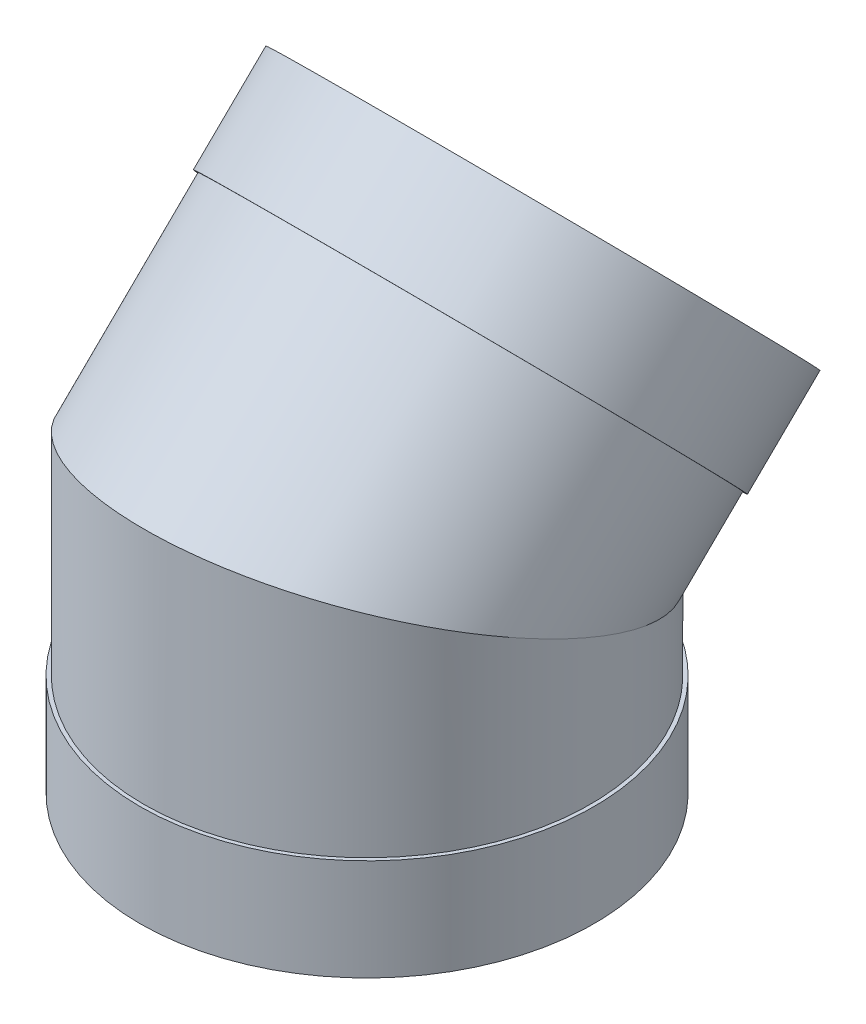
ISO-10303-21;
HEADER;
FILE_DESCRIPTION(('STEP AP214'),'2;1');
FILE_NAME('part.step','',(''),(''),'','','');
FILE_SCHEMA(('AUTOMOTIVE_DESIGN { 1 0 10303 214 1 1 1 1 }'));
ENDSEC;
DATA;
#1=APPLICATION_CONTEXT('core data for automotive mechanical design processes');
#2=APPLICATION_PROTOCOL_DEFINITION('international standard','automotive_design',2000,#1);
#3=PRODUCT_CONTEXT('',#1,'mechanical');
#4=PRODUCT('Part','Part','',(#3));
#5=PRODUCT_RELATED_PRODUCT_CATEGORY('part','',(#4));
#6=PRODUCT_DEFINITION_FORMATION('','',#4);
#7=PRODUCT_DEFINITION_CONTEXT('part definition',#1,'design');
#8=PRODUCT_DEFINITION('design','',#6,#7);
#9=PRODUCT_DEFINITION_SHAPE('','',#8);
#10=(LENGTH_UNIT() NAMED_UNIT(*) SI_UNIT(.MILLI.,.METRE.));
#11=(NAMED_UNIT(*) PLANE_ANGLE_UNIT() SI_UNIT($,.RADIAN.));
#12=(NAMED_UNIT(*) SI_UNIT($,.STERADIAN.) SOLID_ANGLE_UNIT());
#13=UNCERTAINTY_MEASURE_WITH_UNIT(LENGTH_MEASURE(1.E-05),#10,'distance_accuracy_value','');
#14=(GEOMETRIC_REPRESENTATION_CONTEXT(3) GLOBAL_UNCERTAINTY_ASSIGNED_CONTEXT((#13)) GLOBAL_UNIT_ASSIGNED_CONTEXT((#10,
#11,#12)) REPRESENTATION_CONTEXT('',''));
#15=CARTESIAN_POINT('',(0.,0.,0.));
#16=DIRECTION('',(0.,0.,1.));
#17=DIRECTION('',(1.,0.,0.));
#18=AXIS2_PLACEMENT_3D('',#15,#16,#17);
#19=CARTESIAN_POINT('',(0.,577.808035197474,-275.631800032306));
#20=DIRECTION('',(0.,0.699550093273346,-0.714583561944475));
#21=DIRECTION('',(0.,-0.714583561944475,-0.699550093273346));
#22=AXIS2_PLACEMENT_3D('',#19,#20,#21);
#23=CYLINDRICAL_SURFACE('',#22,279.4);
#24=CARTESIAN_POINT('',(0.,434.576078130144,-129.321760122901));
#25=DIRECTION('',(0.,-0.699550093273346,0.714583561944475));
#26=DIRECTION('',(0.,-0.714583561944475,-0.699550093273346));
#27=AXIS2_PLACEMENT_3D('',#24,#25,#26);
#28=CIRCLE('',#27,279.4);
#29=CARTESIAN_POINT('',(0.,234.921430922858,-324.776056183474));
#30=VERTEX_POINT('',#29);
#31=EDGE_CURVE('E67',#30,#30,#28,.T.);
#32=ORIENTED_EDGE('',*,*,#31,.T.);
#33=EDGE_LOOP('',(#32));
#34=FACE_BOUND('',#33,.T.);
#35=CARTESIAN_POINT('',(0.,523.418939975859,-220.07387248985));
#36=DIRECTION('',(0.,-0.699550093273346,0.714583561944475));
#37=DIRECTION('',(0.,-0.714583561944475,-0.699550093273346));
#38=AXIS2_PLACEMENT_3D('',#35,#36,#37);
#39=CIRCLE('',#38,279.4);
#40=CARTESIAN_POINT('',(0.,323.764292768572,-415.528168550422));
#41=VERTEX_POINT('',#40);
#42=EDGE_CURVE('E11',#41,#41,#39,.T.);
#43=ORIENTED_EDGE('',*,*,#42,.F.);
#44=EDGE_LOOP('',(#43));
#45=FACE_BOUND('',#44,.T.);
#46=ADVANCED_FACE('F48',(#34,#45),#23,.F.);
#47=CARTESIAN_POINT('',(0.,723.073587183145,-24.619576429277));
#48=DIRECTION('',(0.,-0.699550093273346,0.714583561944475));
#49=DIRECTION('',(0.,0.714583561944475,0.699550093273346));
#50=AXIS2_PLACEMENT_3D('',#47,#48,#49);
#51=PLANE('',#50);
#52=ORIENTED_EDGE('',*,*,#42,.T.);
#53=EDGE_LOOP('',(#52));
#54=FACE_BOUND('',#53,.T.);
#55=CARTESIAN_POINT('',(0.,523.418939975859,-220.07387248985));
#56=DIRECTION('',(0.,-0.699550093273346,0.714583561944475));
#57=DIRECTION('',(0.,-0.714583561944475,-0.699550093273346));
#58=AXIS2_PLACEMENT_3D('',#55,#56,#57);
#59=CIRCLE('',#58,284.1625);
#60=CARTESIAN_POINT('',(0.,320.361088554812,-418.859775869637));
#61=VERTEX_POINT('',#60);
#62=EDGE_CURVE('E55',#61,#61,#59,.T.);
#63=ORIENTED_EDGE('',*,*,#62,.F.);
#64=EDGE_LOOP('',(#63));
#65=FACE_BOUND('',#64,.T.);
#66=ADVANCED_FACE('F85',(#54,#65),#51,.F.);
#67=CARTESIAN_POINT('',(0.,577.808035197474,-275.631800032306));
#68=DIRECTION('',(0.,0.699550093273346,-0.714583561944475));
#69=DIRECTION('',(0.,-0.714583561944475,-0.699550093273346));
#70=AXIS2_PLACEMENT_3D('',#67,#68,#69);
#71=CYLINDRICAL_SURFACE('',#70,284.1625);
#72=ORIENTED_EDGE('',*,*,#62,.T.);
#73=EDGE_LOOP('',(#72));
#74=FACE_BOUND('',#73,.T.);
#75=CARTESIAN_POINT('',(0.,434.576078130144,-129.321760122901));
#76=DIRECTION('',(0.,-0.699550093273346,0.714583561944475));
#77=DIRECTION('',(0.,-0.714583561944475,-0.699550093273346));
#78=AXIS2_PLACEMENT_3D('',#75,#76,#77);
#79=CIRCLE('',#78,284.1625);
#80=CARTESIAN_POINT('',(0.,231.518226709097,-328.107663502689));
#81=VERTEX_POINT('',#80);
#82=EDGE_CURVE('E61',#81,#81,#79,.T.);
#83=ORIENTED_EDGE('',*,*,#82,.F.);
#84=EDGE_LOOP('',(#83));
#85=FACE_BOUND('',#84,.T.);
#86=ADVANCED_FACE('F79',(#74,#85),#71,.T.);
#87=CARTESIAN_POINT('',(0.,634.23072533743,66.1325359376712));
#88=DIRECTION('',(0.,0.699550093273346,-0.714583561944475));
#89=DIRECTION('',(0.,-0.714583561944475,-0.699550093273346));
#90=AXIS2_PLACEMENT_3D('',#87,#88,#89);
#91=PLANE('',#90);
#92=ORIENTED_EDGE('',*,*,#82,.T.);
#93=EDGE_LOOP('',(#92));
#94=FACE_BOUND('',#93,.T.);
#95=ORIENTED_EDGE('',*,*,#31,.F.);
#96=EDGE_LOOP('',(#95));
#97=FACE_BOUND('',#96,.T.);
#98=ADVANCED_FACE('F77',(#94,#97),#91,.F.);
#99=CLOSED_SHELL('',(#46,#66,#86,#98));
#100=MANIFOLD_SOLID_BREP('B2',#99);
#101=CARTESIAN_POINT('',(0.,559.875148802204,-257.313532392149));
#102=DIRECTION('',(0.,0.699550093273346,-0.714583561944475));
#103=DIRECTION('',(0.,-0.714583561944475,-0.699550093273346));
#104=AXIS2_PLACEMENT_3D('',#101,#102,#103);
#105=CYLINDRICAL_SURFACE('',#104,279.4);
#106=CARTESIAN_POINT('',(0.,470.11322286843,-165.622605069681));
#107=DIRECTION('',(0.,-0.699550093273346,0.714583561944475));
#108=DIRECTION('',(0.,-0.714583561944475,-0.699550093273346));
#109=AXIS2_PLACEMENT_3D('',#106,#107,#108);
#110=CIRCLE('',#109,279.4);
#111=CARTESIAN_POINT('',(0.,270.458575661144,-361.076901130253));
#112=VERTEX_POINT('',#111);
#113=EDGE_CURVE('E47',#112,#112,#110,.T.);
#114=ORIENTED_EDGE('',*,*,#113,.T.);
#115=EDGE_LOOP('',(#114));
#116=FACE_BOUND('',#115,.T.);
#117=CARTESIAN_POINT('',(0.,307.975,0.));
#118=DIRECTION('',(0.,-0.921832439566255,0.387588639363085));
#119=DIRECTION('',(0.,-0.387588639363085,-0.921832439566255));
#120=AXIS2_PLACEMENT_3D('',#117,#118,#119);
#121=ELLIPSE('',#120,303.09195902399,279.4);
#122=CARTESIAN_POINT('',(0.,190.5,-279.4));
#123=VERTEX_POINT('',#122);
#124=EDGE_CURVE('E148',#123,#123,#121,.T.);
#125=ORIENTED_EDGE('',*,*,#124,.F.);
#126=EDGE_LOOP('',(#125));
#127=FACE_BOUND('',#126,.T.);
#128=ADVANCED_FACE('F134',(#116,#127),#105,.T.);
#129=CARTESIAN_POINT('',(0.,666.364665861955,26.5000836716776));
#130=DIRECTION('',(0.,-0.699550093273346,0.714583561944475));
#131=DIRECTION('',(0.,0.714583561944475,0.699550093273346));
#132=AXIS2_PLACEMENT_3D('',#129,#130,#131);
#133=PLANE('',#132);
#134=CARTESIAN_POINT('',(0.,470.11322286843,-165.622605069681));
#135=DIRECTION('',(0.,-0.699550093273346,0.714583561944475));
#136=DIRECTION('',(0.,-0.714583561944475,-0.699550093273346));
#137=AXIS2_PLACEMENT_3D('',#134,#135,#136);
#138=CIRCLE('',#137,274.6375);
#139=CARTESIAN_POINT('',(0.,273.861779874904,-357.745293811039));
#140=VERTEX_POINT('',#139);
#141=EDGE_CURVE('E142',#140,#140,#138,.T.);
#142=ORIENTED_EDGE('',*,*,#141,.T.);
#143=EDGE_LOOP('',(#142));
#144=FACE_BOUND('',#143,.T.);
#145=ORIENTED_EDGE('',*,*,#113,.F.);
#146=EDGE_LOOP('',(#145));
#147=FACE_BOUND('',#146,.T.);
#148=ADVANCED_FACE('F166',(#144,#147),#133,.F.);
#149=CARTESIAN_POINT('',(0.,559.875148802204,-257.313532392149));
#150=DIRECTION('',(0.,0.699550093273346,-0.714583561944475));
#151=DIRECTION('',(0.,-0.714583561944475,-0.699550093273346));
#152=AXIS2_PLACEMENT_3D('',#149,#150,#151);
#153=CYLINDRICAL_SURFACE('',#152,274.6375);
#154=CARTESIAN_POINT('',(0.,307.975,0.));
#155=DIRECTION('',(0.,-0.921832439566255,0.387588639363085));
#156=DIRECTION('',(0.,-0.387588639363085,-0.921832439566255));
#157=AXIS2_PLACEMENT_3D('',#154,#155,#156);
#158=ELLIPSE('',#157,297.925618813354,274.6375);
#159=CARTESIAN_POINT('',(0.,192.502414772727,-274.6375));
#160=VERTEX_POINT('',#159);
#161=EDGE_CURVE('E137',#160,#160,#158,.F.);
#162=ORIENTED_EDGE('',*,*,#161,.F.);
#163=EDGE_LOOP('',(#162));
#164=FACE_BOUND('',#163,.T.);
#165=ORIENTED_EDGE('',*,*,#141,.F.);
#166=EDGE_LOOP('',(#165));
#167=FACE_BOUND('',#166,.T.);
#168=ADVANCED_FACE('F163',(#164,#167),#153,.F.);
#169=CARTESIAN_POINT('',(-284.1625,425.45,279.4));
#170=DIRECTION('',(0.,0.921832439566255,-0.387588639363085));
#171=DIRECTION('',(0.,-0.387588639363085,-0.921832439566255));
#172=AXIS2_PLACEMENT_3D('',#169,#170,#171);
#173=PLANE('',#172);
#174=ORIENTED_EDGE('',*,*,#161,.T.);
#175=EDGE_LOOP('',(#174));
#176=FACE_BOUND('',#175,.T.);
#177=ORIENTED_EDGE('',*,*,#124,.T.);
#178=EDGE_LOOP('',(#177));
#179=FACE_BOUND('',#178,.T.);
#180=ADVANCED_FACE('F161',(#176,#179),#173,.F.);
#181=CLOSED_SHELL('',(#128,#148,#168,#180));
#182=MANIFOLD_SOLID_BREP('B6',#181);
#183=CARTESIAN_POINT('',(0.,-77.7486783928749,0.));
#184=DIRECTION('',(0.,-1.,0.));
#185=DIRECTION('',(0.,0.,-1.));
#186=AXIS2_PLACEMENT_3D('',#183,#184,#185);
#187=CYLINDRICAL_SURFACE('',#186,279.4);
#188=CARTESIAN_POINT('',(0.,127.,0.));
#189=DIRECTION('',(0.,-1.,0.));
#190=DIRECTION('',(0.,0.,-1.));
#191=AXIS2_PLACEMENT_3D('',#188,#189,#190);
#192=CIRCLE('',#191,279.4);
#193=CARTESIAN_POINT('',(0.,127.,-279.4));
#194=VERTEX_POINT('',#193);
#195=EDGE_CURVE('E238',#194,#194,#192,.T.);
#196=ORIENTED_EDGE('',*,*,#195,.F.);
#197=EDGE_LOOP('',(#196));
#198=FACE_BOUND('',#197,.T.);
#199=CARTESIAN_POINT('',(0.,0.,0.));
#200=DIRECTION('',(0.,-1.,0.));
#201=DIRECTION('',(0.,0.,-1.));
#202=AXIS2_PLACEMENT_3D('',#199,#200,#201);
#203=CIRCLE('',#202,279.4);
#204=CARTESIAN_POINT('',(0.,0.,-279.4));
#205=VERTEX_POINT('',#204);
#206=EDGE_CURVE('E133',#205,#205,#203,.T.);
#207=ORIENTED_EDGE('',*,*,#206,.T.);
#208=EDGE_LOOP('',(#207));
#209=FACE_BOUND('',#208,.T.);
#210=ADVANCED_FACE('F219',(#198,#209),#187,.F.);
#211=CARTESIAN_POINT('',(0.,0.,279.4));
#212=DIRECTION('',(0.,1.,0.));
#213=DIRECTION('',(0.,0.,1.));
#214=AXIS2_PLACEMENT_3D('',#211,#212,#213);
#215=PLANE('',#214);
#216=ORIENTED_EDGE('',*,*,#206,.F.);
#217=EDGE_LOOP('',(#216));
#218=FACE_BOUND('',#217,.T.);
#219=CARTESIAN_POINT('',(0.,0.,0.));
#220=DIRECTION('',(0.,-1.,0.));
#221=DIRECTION('',(0.,0.,-1.));
#222=AXIS2_PLACEMENT_3D('',#219,#220,#221);
#223=CIRCLE('',#222,284.1625);
#224=CARTESIAN_POINT('',(0.,0.,-284.1625));
#225=VERTEX_POINT('',#224);
#226=EDGE_CURVE('E226',#225,#225,#223,.T.);
#227=ORIENTED_EDGE('',*,*,#226,.T.);
#228=EDGE_LOOP('',(#227));
#229=FACE_BOUND('',#228,.T.);
#230=ADVANCED_FACE('F249',(#218,#229),#215,.F.);
#231=CARTESIAN_POINT('',(0.,-77.7486783928749,0.));
#232=DIRECTION('',(0.,-1.,0.));
#233=DIRECTION('',(0.,0.,-1.));
#234=AXIS2_PLACEMENT_3D('',#231,#232,#233);
#235=CYLINDRICAL_SURFACE('',#234,284.1625);
#236=ORIENTED_EDGE('',*,*,#226,.F.);
#237=EDGE_LOOP('',(#236));
#238=FACE_BOUND('',#237,.T.);
#239=CARTESIAN_POINT('',(0.,127.,0.));
#240=DIRECTION('',(0.,-1.,0.));
#241=DIRECTION('',(0.,0.,-1.));
#242=AXIS2_PLACEMENT_3D('',#239,#240,#241);
#243=CIRCLE('',#242,284.1625);
#244=CARTESIAN_POINT('',(0.,127.,-284.1625));
#245=VERTEX_POINT('',#244);
#246=EDGE_CURVE('E232',#245,#245,#243,.T.);
#247=ORIENTED_EDGE('',*,*,#246,.T.);
#248=EDGE_LOOP('',(#247));
#249=FACE_BOUND('',#248,.T.);
#250=ADVANCED_FACE('F253',(#238,#249),#235,.T.);
#251=CARTESIAN_POINT('',(0.,127.,279.4));
#252=DIRECTION('',(0.,-1.,0.));
#253=DIRECTION('',(0.,0.,-1.));
#254=AXIS2_PLACEMENT_3D('',#251,#252,#253);
#255=PLANE('',#254);
#256=ORIENTED_EDGE('',*,*,#246,.F.);
#257=EDGE_LOOP('',(#256));
#258=FACE_BOUND('',#257,.T.);
#259=ORIENTED_EDGE('',*,*,#195,.T.);
#260=EDGE_LOOP('',(#259));
#261=FACE_BOUND('',#260,.T.);
#262=ADVANCED_FACE('F246',(#258,#261),#255,.F.);
#263=CLOSED_SHELL('',(#210,#230,#250,#262));
#264=MANIFOLD_SOLID_BREP('B42',#263);
#265=CARTESIAN_POINT('',(0.,-52.1137931034483,0.));
#266=DIRECTION('',(0.,-1.,0.));
#267=DIRECTION('',(0.,0.,-1.));
#268=AXIS2_PLACEMENT_3D('',#265,#266,#267);
#269=CYLINDRICAL_SURFACE('',#268,279.4);
#270=CARTESIAN_POINT('',(0.,76.2,0.));
#271=DIRECTION('',(0.,-1.,0.));
#272=DIRECTION('',(0.,0.,-1.));
#273=AXIS2_PLACEMENT_3D('',#270,#271,#272);
#274=CIRCLE('',#273,279.4);
#275=CARTESIAN_POINT('',(0.,76.2,-279.4));
#276=VERTEX_POINT('',#275);
#277=EDGE_CURVE('E218',#276,#276,#274,.T.);
#278=ORIENTED_EDGE('',*,*,#277,.F.);
#279=EDGE_LOOP('',(#278));
#280=FACE_BOUND('',#279,.T.);
#281=CARTESIAN_POINT('',(0.,307.975,0.));
#282=DIRECTION('',(0.,-0.921832439566255,0.387588639363084));
#283=DIRECTION('',(0.,-0.387588639363085,-0.921832439566255));
#284=AXIS2_PLACEMENT_3D('',#281,#282,#283);
#285=ELLIPSE('',#284,303.09195902399,279.4);
#286=CARTESIAN_POINT('',(0.,190.5,-279.4));
#287=VERTEX_POINT('',#286);
#288=EDGE_CURVE('E311',#287,#287,#285,.T.);
#289=ORIENTED_EDGE('',*,*,#288,.T.);
#290=EDGE_LOOP('',(#289));
#291=FACE_BOUND('',#290,.T.);
#292=ADVANCED_FACE('F297',(#280,#291),#269,.T.);
#293=CARTESIAN_POINT('',(0.,76.2,274.6375));
#294=DIRECTION('',(0.,1.,0.));
#295=DIRECTION('',(0.,0.,1.));
#296=AXIS2_PLACEMENT_3D('',#293,#294,#295);
#297=PLANE('',#296);
#298=CARTESIAN_POINT('',(0.,76.2,0.));
#299=DIRECTION('',(0.,-1.,0.));
#300=DIRECTION('',(0.,0.,-1.));
#301=AXIS2_PLACEMENT_3D('',#298,#299,#300);
#302=CIRCLE('',#301,274.6375);
#303=CARTESIAN_POINT('',(0.,76.2,-274.6375));
#304=VERTEX_POINT('',#303);
#305=EDGE_CURVE('E305',#304,#304,#302,.T.);
#306=ORIENTED_EDGE('',*,*,#305,.F.);
#307=EDGE_LOOP('',(#306));
#308=FACE_BOUND('',#307,.T.);
#309=ORIENTED_EDGE('',*,*,#277,.T.);
#310=EDGE_LOOP('',(#309));
#311=FACE_BOUND('',#310,.T.);
#312=ADVANCED_FACE('F334',(#308,#311),#297,.F.);
#313=CARTESIAN_POINT('',(0.,-52.1137931034483,0.));
#314=DIRECTION('',(0.,-1.,0.));
#315=DIRECTION('',(0.,0.,-1.));
#316=AXIS2_PLACEMENT_3D('',#313,#314,#315);
#317=CYLINDRICAL_SURFACE('',#316,274.6375);
#318=CARTESIAN_POINT('',(0.,307.975,0.));
#319=DIRECTION('',(0.,-0.921832439566255,0.387588639363084));
#320=DIRECTION('',(0.,-0.387588639363085,-0.921832439566255));
#321=AXIS2_PLACEMENT_3D('',#318,#319,#320);
#322=ELLIPSE('',#321,297.925618813354,274.6375);
#323=CARTESIAN_POINT('',(0.,192.502414772727,-274.6375));
#324=VERTEX_POINT('',#323);
#325=EDGE_CURVE('E300',#324,#324,#322,.F.);
#326=ORIENTED_EDGE('',*,*,#325,.T.);
#327=EDGE_LOOP('',(#326));
#328=FACE_BOUND('',#327,.T.);
#329=ORIENTED_EDGE('',*,*,#305,.T.);
#330=EDGE_LOOP('',(#329));
#331=FACE_BOUND('',#330,.T.);
#332=ADVANCED_FACE('F324',(#328,#331),#317,.F.);
#333=CARTESIAN_POINT('',(-284.1625,425.45,279.4));
#334=DIRECTION('',(0.,-0.921832439566255,0.387588639363084));
#335=DIRECTION('',(0.,-0.387588639363085,-0.921832439566255));
#336=AXIS2_PLACEMENT_3D('',#333,#334,#335);
#337=PLANE('',#336);
#338=ORIENTED_EDGE('',*,*,#325,.F.);
#339=EDGE_LOOP('',(#338));
#340=FACE_BOUND('',#339,.T.);
#341=ORIENTED_EDGE('',*,*,#288,.F.);
#342=EDGE_LOOP('',(#341));
#343=FACE_BOUND('',#342,.T.);
#344=ADVANCED_FACE('F327',(#340,#343),#337,.F.);
#345=CLOSED_SHELL('',(#292,#312,#332,#344));
#346=MANIFOLD_SOLID_BREP('B128',#345);
#347=ADVANCED_BREP_SHAPE_REPRESENTATION('',(#18,#100,#182,#264,#346),#14);
#348=SHAPE_DEFINITION_REPRESENTATION(#9,#347);
ENDSEC;
END-ISO-10303-21;
